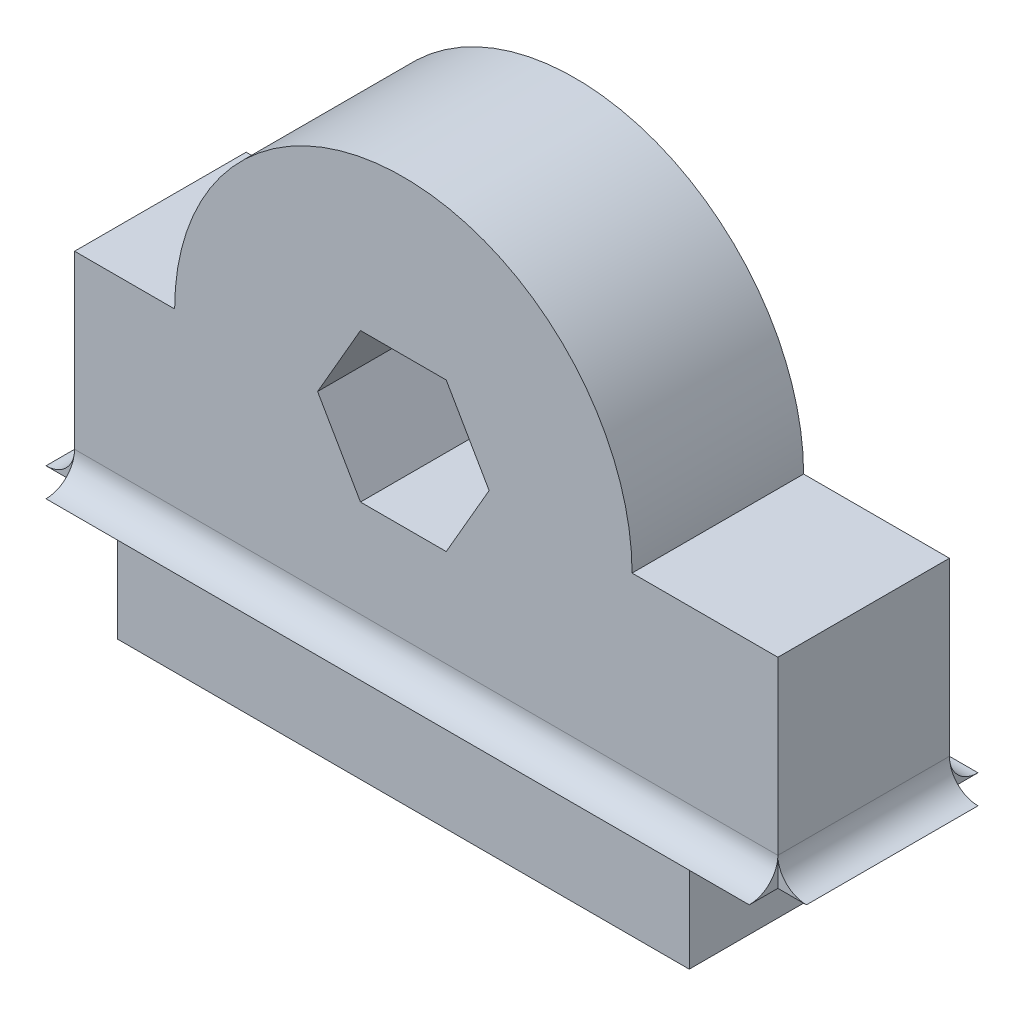
ISO-10303-21;
HEADER;
FILE_DESCRIPTION(('STEP AP214'),'2;1');
FILE_NAME('part.step','',(''),(''),'','','');
FILE_SCHEMA(('AUTOMOTIVE_DESIGN { 1 0 10303 214 1 1 1 1 }'));
ENDSEC;
DATA;
#1=APPLICATION_CONTEXT('core data for automotive mechanical design processes');
#2=APPLICATION_PROTOCOL_DEFINITION('international standard','automotive_design',2000,#1);
#3=PRODUCT_CONTEXT('',#1,'mechanical');
#4=PRODUCT('Part','Part','',(#3));
#5=PRODUCT_RELATED_PRODUCT_CATEGORY('part','',(#4));
#6=PRODUCT_DEFINITION_FORMATION('','',#4);
#7=PRODUCT_DEFINITION_CONTEXT('part definition',#1,'design');
#8=PRODUCT_DEFINITION('design','',#6,#7);
#9=PRODUCT_DEFINITION_SHAPE('','',#8);
#10=(LENGTH_UNIT() NAMED_UNIT(*) SI_UNIT(.MILLI.,.METRE.));
#11=(NAMED_UNIT(*) PLANE_ANGLE_UNIT() SI_UNIT($,.RADIAN.));
#12=(NAMED_UNIT(*) SI_UNIT($,.STERADIAN.) SOLID_ANGLE_UNIT());
#13=UNCERTAINTY_MEASURE_WITH_UNIT(LENGTH_MEASURE(1.E-05),#10,'distance_accuracy_value','');
#14=(GEOMETRIC_REPRESENTATION_CONTEXT(3) GLOBAL_UNCERTAINTY_ASSIGNED_CONTEXT((#13)) GLOBAL_UNIT_ASSIGNED_CONTEXT((#10,
#11,#12)) REPRESENTATION_CONTEXT('',''));
#15=CARTESIAN_POINT('',(0.,0.,0.));
#16=DIRECTION('',(0.,0.,1.));
#17=DIRECTION('',(1.,0.,0.));
#18=AXIS2_PLACEMENT_3D('',#15,#16,#17);
#19=CARTESIAN_POINT('',(-1.5,4.,6.));
#20=DIRECTION('',(1.,0.,0.));
#21=DIRECTION('',(0.,0.,-1.));
#22=AXIS2_PLACEMENT_3D('',#19,#20,#21);
#23=PLANE('',#22);
#24=DIRECTION('',(0.,1.,0.));
#25=VECTOR('',#24,1.);
#26=CARTESIAN_POINT('',(-1.5,4.,6.));
#27=LINE('',#26,#25);
#28=CARTESIAN_POINT('',(-1.5,4.,6.));
#29=VERTEX_POINT('',#28);
#30=CARTESIAN_POINT('',(-1.49999999999999,5.,6.));
#31=VERTEX_POINT('',#30);
#32=EDGE_CURVE('E190',#29,#31,#27,.T.);
#33=ORIENTED_EDGE('',*,*,#32,.F.);
#34=DIRECTION('',(0.,0.,-1.));
#35=VECTOR('',#34,1.);
#36=CARTESIAN_POINT('',(-1.5,4.,6.));
#37=LINE('',#36,#35);
#38=CARTESIAN_POINT('',(-1.5,4.,7.));
#39=VERTEX_POINT('',#38);
#40=EDGE_CURVE('E196',#39,#29,#37,.T.);
#41=ORIENTED_EDGE('',*,*,#40,.F.);
#42=CARTESIAN_POINT('',(-1.5,5.,7.));
#43=DIRECTION('',(1.,0.,0.));
#44=DIRECTION('',(0.,0.,1.));
#45=AXIS2_PLACEMENT_3D('',#42,#43,#44);
#46=CIRCLE('',#45,1.);
#47=EDGE_CURVE('E236',#39,#31,#46,.T.);
#48=ORIENTED_EDGE('',*,*,#47,.T.);
#49=EDGE_LOOP('',(#33,#41,#48));
#50=FACE_BOUND('',#49,.T.);
#51=ADVANCED_FACE('F33',(#50),#23,.F.);
#52=DIRECTION('',(0.,0.,1.));
#53=VECTOR('',#52,1.);
#54=CARTESIAN_POINT('',(-1.49999999999999,5.,-1.4142135623731));
#55=LINE('',#54,#53);
#56=CARTESIAN_POINT('',(-1.49999999999999,5.,0.));
#57=VERTEX_POINT('',#56);
#58=EDGE_CURVE('E189',#57,#31,#55,.T.);
#59=ORIENTED_EDGE('',*,*,#58,.T.);
#60=DIRECTION('',(0.,-1.,0.));
#61=VECTOR('',#60,1.);
#62=CARTESIAN_POINT('',(-1.5,4.,6.));
#63=LINE('',#62,#61);
#64=CARTESIAN_POINT('',(-1.5,11.,6.));
#65=VERTEX_POINT('',#64);
#66=EDGE_CURVE('E321',#65,#31,#63,.T.);
#67=ORIENTED_EDGE('',*,*,#66,.F.);
#68=DIRECTION('',(0.,0.,-1.));
#69=VECTOR('',#68,1.);
#70=CARTESIAN_POINT('',(-1.5,11.,6.));
#71=LINE('',#70,#69);
#72=CARTESIAN_POINT('',(-1.5,11.,0.));
#73=VERTEX_POINT('',#72);
#74=EDGE_CURVE('E346',#65,#73,#71,.T.);
#75=ORIENTED_EDGE('',*,*,#74,.T.);
#76=DIRECTION('',(0.,-1.,0.));
#77=VECTOR('',#76,1.);
#78=CARTESIAN_POINT('',(-1.5,4.,0.));
#79=LINE('',#78,#77);
#80=EDGE_CURVE('E309',#73,#57,#79,.T.);
#81=ORIENTED_EDGE('',*,*,#80,.T.);
#82=EDGE_LOOP('',(#59,#67,#75,#81));
#83=FACE_BOUND('',#82,.T.);
#84=ADVANCED_FACE('F389',(#83),#23,.F.);
#85=DIRECTION('',(0.,-1.,0.));
#86=VECTOR('',#85,1.);
#87=CARTESIAN_POINT('',(-1.5,4.,0.));
#88=LINE('',#87,#86);
#89=CARTESIAN_POINT('',(-1.5,4.,0.));
#90=VERTEX_POINT('',#89);
#91=EDGE_CURVE('E207',#57,#90,#88,.T.);
#92=ORIENTED_EDGE('',*,*,#91,.F.);
#93=CARTESIAN_POINT('',(-1.5,5.,-1.));
#94=DIRECTION('',(1.,0.,0.));
#95=DIRECTION('',(0.,0.,-1.));
#96=AXIS2_PLACEMENT_3D('',#93,#94,#95);
#97=CIRCLE('',#96,1.);
#98=CARTESIAN_POINT('',(-1.5,4.,-1.));
#99=VERTEX_POINT('',#98);
#100=EDGE_CURVE('E232',#57,#99,#97,.T.);
#101=ORIENTED_EDGE('',*,*,#100,.T.);
#102=EDGE_CURVE('E344',#90,#99,#37,.T.);
#103=ORIENTED_EDGE('',*,*,#102,.F.);
#104=EDGE_LOOP('',(#92,#101,#103));
#105=FACE_BOUND('',#104,.T.);
#106=ADVANCED_FACE('F392',(#105),#23,.F.);
#107=CARTESIAN_POINT('',(23.1,11.,6.));
#108=DIRECTION('',(-1.,0.,0.));
#109=DIRECTION('',(0.,0.,1.));
#110=AXIS2_PLACEMENT_3D('',#107,#108,#109);
#111=PLANE('',#110);
#112=DIRECTION('',(0.,0.,-1.));
#113=VECTOR('',#112,1.);
#114=CARTESIAN_POINT('',(23.1,4.,6.));
#115=LINE('',#114,#113);
#116=CARTESIAN_POINT('',(23.1,4.,7.));
#117=VERTEX_POINT('',#116);
#118=CARTESIAN_POINT('',(23.1,4.,6.));
#119=VERTEX_POINT('',#118);
#120=EDGE_CURVE('E56',#117,#119,#115,.T.);
#121=ORIENTED_EDGE('',*,*,#120,.T.);
#122=DIRECTION('',(0.,-1.,0.));
#123=VECTOR('',#122,1.);
#124=CARTESIAN_POINT('',(23.1,4.,6.));
#125=LINE('',#124,#123);
#126=CARTESIAN_POINT('',(23.1,5.,6.));
#127=VERTEX_POINT('',#126);
#128=EDGE_CURVE('E224',#127,#119,#125,.T.);
#129=ORIENTED_EDGE('',*,*,#128,.F.);
#130=CARTESIAN_POINT('',(23.1,5.,7.));
#131=DIRECTION('',(-1.,0.,0.));
#132=DIRECTION('',(0.,0.,1.));
#133=AXIS2_PLACEMENT_3D('',#130,#131,#132);
#134=CIRCLE('',#133,1.);
#135=EDGE_CURVE('E253',#127,#117,#134,.T.);
#136=ORIENTED_EDGE('',*,*,#135,.T.);
#137=EDGE_LOOP('',(#121,#129,#136));
#138=FACE_BOUND('',#137,.T.);
#139=ADVANCED_FACE('F400',(#138),#111,.F.);
#140=DIRECTION('',(0.,1.,0.));
#141=VECTOR('',#140,1.);
#142=CARTESIAN_POINT('',(23.1,4.,0.));
#143=LINE('',#142,#141);
#144=CARTESIAN_POINT('',(23.1,4.,0.));
#145=VERTEX_POINT('',#144);
#146=CARTESIAN_POINT('',(23.1,5.,0.));
#147=VERTEX_POINT('',#146);
#148=EDGE_CURVE('E211',#145,#147,#143,.T.);
#149=ORIENTED_EDGE('',*,*,#148,.F.);
#150=CARTESIAN_POINT('',(23.1,4.,-1.));
#151=VERTEX_POINT('',#150);
#152=EDGE_CURVE('E358',#145,#151,#115,.T.);
#153=ORIENTED_EDGE('',*,*,#152,.T.);
#154=CARTESIAN_POINT('',(23.1,5.,-1.));
#155=DIRECTION('',(-1.,0.,0.));
#156=DIRECTION('',(0.,0.,1.));
#157=AXIS2_PLACEMENT_3D('',#154,#155,#156);
#158=CIRCLE('',#157,1.);
#159=EDGE_CURVE('E233',#151,#147,#158,.T.);
#160=ORIENTED_EDGE('',*,*,#159,.T.);
#161=EDGE_LOOP('',(#149,#153,#160));
#162=FACE_BOUND('',#161,.T.);
#163=ADVANCED_FACE('F405',(#162),#111,.F.);
#164=CARTESIAN_POINT('',(10.,11.,0.));
#165=DIRECTION('',(0.,0.,1.));
#166=DIRECTION('',(1.,0.,0.));
#167=AXIS2_PLACEMENT_3D('',#164,#165,#166);
#168=PLANE('',#167);
#169=DIRECTION('',(0.499999999999995,0.866025403784441,0.));
#170=VECTOR('',#169,1.);
#171=CARTESIAN_POINT('',(11.5,8.4019237886467,0.));
#172=LINE('',#171,#170);
#173=CARTESIAN_POINT('',(11.5,8.4019237886467,0.));
#174=VERTEX_POINT('',#173);
#175=CARTESIAN_POINT('',(13.,11.,0.));
#176=VERTEX_POINT('',#175);
#177=EDGE_CURVE('E259',#174,#176,#172,.T.);
#178=ORIENTED_EDGE('',*,*,#177,.T.);
#179=DIRECTION('',(-0.500000000000001,0.866025403784438,0.));
#180=VECTOR('',#179,1.);
#181=CARTESIAN_POINT('',(13.,11.,0.));
#182=LINE('',#181,#180);
#183=CARTESIAN_POINT('',(11.5,13.5980762113533,0.));
#184=VERTEX_POINT('',#183);
#185=EDGE_CURVE('E277',#176,#184,#182,.T.);
#186=ORIENTED_EDGE('',*,*,#185,.T.);
#187=DIRECTION('',(-1.,0.,0.));
#188=VECTOR('',#187,1.);
#189=CARTESIAN_POINT('',(11.5,13.5980762113533,0.));
#190=LINE('',#189,#188);
#191=CARTESIAN_POINT('',(8.49999999999999,13.5980762113533,0.));
#192=VERTEX_POINT('',#191);
#193=EDGE_CURVE('E280',#184,#192,#190,.T.);
#194=ORIENTED_EDGE('',*,*,#193,.T.);
#195=DIRECTION('',(-0.499999999999995,-0.866025403784441,0.));
#196=VECTOR('',#195,1.);
#197=CARTESIAN_POINT('',(8.49999999999999,13.5980762113533,0.));
#198=LINE('',#197,#196);
#199=CARTESIAN_POINT('',(7.,11.,0.));
#200=VERTEX_POINT('',#199);
#201=EDGE_CURVE('E283',#192,#200,#198,.T.);
#202=ORIENTED_EDGE('',*,*,#201,.T.);
#203=DIRECTION('',(0.500000000000007,-0.866025403784435,0.));
#204=VECTOR('',#203,1.);
#205=CARTESIAN_POINT('',(7.,11.,0.));
#206=LINE('',#205,#204);
#207=CARTESIAN_POINT('',(8.50000000000002,8.40192378864667,0.));
#208=VERTEX_POINT('',#207);
#209=EDGE_CURVE('E286',#200,#208,#206,.T.);
#210=ORIENTED_EDGE('',*,*,#209,.T.);
#211=DIRECTION('',(1.,0.,0.));
#212=VECTOR('',#211,1.);
#213=CARTESIAN_POINT('',(8.50000000000002,8.40192378864667,0.));
#214=LINE('',#213,#212);
#215=EDGE_CURVE('E263',#208,#174,#214,.T.);
#216=ORIENTED_EDGE('',*,*,#215,.T.);
#217=EDGE_LOOP('',(#178,#186,#194,#202,#210,#216));
#218=FACE_BOUND('',#217,.T.);
#219=DIRECTION('',(-1.,0.,0.));
#220=VECTOR('',#219,1.);
#221=CARTESIAN_POINT('',(24.5142135623731,5.,0.));
#222=LINE('',#221,#220);
#223=EDGE_CURVE('E237',#147,#57,#222,.T.);
#224=ORIENTED_EDGE('',*,*,#223,.T.);
#225=ORIENTED_EDGE('',*,*,#80,.F.);
#226=DIRECTION('',(-1.,0.,0.));
#227=VECTOR('',#226,1.);
#228=CARTESIAN_POINT('',(-1.5,11.,0.));
#229=LINE('',#228,#227);
#230=CARTESIAN_POINT('',(2.,11.,0.));
#231=VERTEX_POINT('',#230);
#232=EDGE_CURVE('E338',#231,#73,#229,.T.);
#233=ORIENTED_EDGE('',*,*,#232,.F.);
#234=CARTESIAN_POINT('',(10.,11.,0.));
#235=DIRECTION('',(0.,0.,1.));
#236=DIRECTION('',(1.,0.,0.));
#237=AXIS2_PLACEMENT_3D('',#234,#235,#236);
#238=CIRCLE('',#237,8.);
#239=CARTESIAN_POINT('',(18.,11.,0.));
#240=VERTEX_POINT('',#239);
#241=EDGE_CURVE('E336',#240,#231,#238,.T.);
#242=ORIENTED_EDGE('',*,*,#241,.F.);
#243=DIRECTION('',(-1.,0.,0.));
#244=VECTOR('',#243,1.);
#245=CARTESIAN_POINT('',(18.,11.,0.));
#246=LINE('',#245,#244);
#247=CARTESIAN_POINT('',(23.1,11.,0.));
#248=VERTEX_POINT('',#247);
#249=EDGE_CURVE('E334',#248,#240,#246,.T.);
#250=ORIENTED_EDGE('',*,*,#249,.F.);
#251=DIRECTION('',(0.,1.,0.));
#252=VECTOR('',#251,1.);
#253=CARTESIAN_POINT('',(23.1,11.,0.));
#254=LINE('',#253,#252);
#255=EDGE_CURVE('E332',#147,#248,#254,.T.);
#256=ORIENTED_EDGE('',*,*,#255,.F.);
#257=EDGE_LOOP('',(#224,#225,#233,#242,#250,#256));
#258=FACE_BOUND('',#257,.T.);
#259=ADVANCED_FACE('F419',(#218,#258),#168,.F.);
#260=CARTESIAN_POINT('',(10.,11.,6.));
#261=DIRECTION('',(0.,0.,1.));
#262=DIRECTION('',(1.,0.,0.));
#263=AXIS2_PLACEMENT_3D('',#260,#261,#262);
#264=PLANE('',#263);
#265=DIRECTION('',(-0.500000000000001,0.866025403784438,0.));
#266=VECTOR('',#265,1.);
#267=CARTESIAN_POINT('',(13.,11.,6.));
#268=LINE('',#267,#266);
#269=CARTESIAN_POINT('',(13.,11.,6.));
#270=VERTEX_POINT('',#269);
#271=CARTESIAN_POINT('',(11.5,13.5980762113533,6.));
#272=VERTEX_POINT('',#271);
#273=EDGE_CURVE('E262',#270,#272,#268,.T.);
#274=ORIENTED_EDGE('',*,*,#273,.F.);
#275=DIRECTION('',(0.499999999999995,0.866025403784441,0.));
#276=VECTOR('',#275,1.);
#277=CARTESIAN_POINT('',(11.5,8.4019237886467,6.));
#278=LINE('',#277,#276);
#279=CARTESIAN_POINT('',(11.5,8.4019237886467,6.));
#280=VERTEX_POINT('',#279);
#281=EDGE_CURVE('E260',#280,#270,#278,.T.);
#282=ORIENTED_EDGE('',*,*,#281,.F.);
#283=DIRECTION('',(1.,0.,0.));
#284=VECTOR('',#283,1.);
#285=CARTESIAN_POINT('',(8.50000000000002,8.40192378864667,6.));
#286=LINE('',#285,#284);
#287=CARTESIAN_POINT('',(8.50000000000002,8.40192378864667,6.));
#288=VERTEX_POINT('',#287);
#289=EDGE_CURVE('E272',#288,#280,#286,.T.);
#290=ORIENTED_EDGE('',*,*,#289,.F.);
#291=DIRECTION('',(0.500000000000007,-0.866025403784435,0.));
#292=VECTOR('',#291,1.);
#293=CARTESIAN_POINT('',(7.,11.,6.));
#294=LINE('',#293,#292);
#295=CARTESIAN_POINT('',(7.,11.,6.));
#296=VERTEX_POINT('',#295);
#297=EDGE_CURVE('E269',#296,#288,#294,.T.);
#298=ORIENTED_EDGE('',*,*,#297,.F.);
#299=DIRECTION('',(-0.499999999999995,-0.866025403784441,0.));
#300=VECTOR('',#299,1.);
#301=CARTESIAN_POINT('',(8.49999999999999,13.5980762113533,6.));
#302=LINE('',#301,#300);
#303=CARTESIAN_POINT('',(8.49999999999999,13.5980762113533,6.));
#304=VERTEX_POINT('',#303);
#305=EDGE_CURVE('E267',#304,#296,#302,.T.);
#306=ORIENTED_EDGE('',*,*,#305,.F.);
#307=DIRECTION('',(-1.,0.,0.));
#308=VECTOR('',#307,1.);
#309=CARTESIAN_POINT('',(11.5,13.5980762113533,6.));
#310=LINE('',#309,#308);
#311=EDGE_CURVE('E265',#272,#304,#310,.T.);
#312=ORIENTED_EDGE('',*,*,#311,.F.);
#313=EDGE_LOOP('',(#274,#282,#290,#298,#306,#312));
#314=FACE_BOUND('',#313,.T.);
#315=ORIENTED_EDGE('',*,*,#66,.T.);
#316=DIRECTION('',(-1.,0.,0.));
#317=VECTOR('',#316,1.);
#318=CARTESIAN_POINT('',(24.5142135623731,5.,6.));
#319=LINE('',#318,#317);
#320=EDGE_CURVE('E254',#127,#31,#319,.T.);
#321=ORIENTED_EDGE('',*,*,#320,.F.);
#322=DIRECTION('',(0.,1.,0.));
#323=VECTOR('',#322,1.);
#324=CARTESIAN_POINT('',(23.1,11.,6.));
#325=LINE('',#324,#323);
#326=CARTESIAN_POINT('',(23.1,11.,6.));
#327=VERTEX_POINT('',#326);
#328=EDGE_CURVE('E313',#127,#327,#325,.T.);
#329=ORIENTED_EDGE('',*,*,#328,.T.);
#330=DIRECTION('',(-1.,0.,0.));
#331=VECTOR('',#330,1.);
#332=CARTESIAN_POINT('',(18.,11.,6.));
#333=LINE('',#332,#331);
#334=CARTESIAN_POINT('',(18.,11.,6.));
#335=VERTEX_POINT('',#334);
#336=EDGE_CURVE('E315',#327,#335,#333,.T.);
#337=ORIENTED_EDGE('',*,*,#336,.T.);
#338=CARTESIAN_POINT('',(10.,11.,6.));
#339=DIRECTION('',(0.,0.,1.));
#340=DIRECTION('',(1.,0.,0.));
#341=AXIS2_PLACEMENT_3D('',#338,#339,#340);
#342=CIRCLE('',#341,8.);
#343=CARTESIAN_POINT('',(2.,11.,6.));
#344=VERTEX_POINT('',#343);
#345=EDGE_CURVE('E317',#335,#344,#342,.T.);
#346=ORIENTED_EDGE('',*,*,#345,.T.);
#347=DIRECTION('',(-1.,0.,0.));
#348=VECTOR('',#347,1.);
#349=CARTESIAN_POINT('',(-1.5,11.,6.));
#350=LINE('',#349,#348);
#351=EDGE_CURVE('E319',#344,#65,#350,.T.);
#352=ORIENTED_EDGE('',*,*,#351,.T.);
#353=EDGE_LOOP('',(#315,#321,#329,#337,#346,#352));
#354=FACE_BOUND('',#353,.T.);
#355=ADVANCED_FACE('F457',(#314,#354),#264,.T.);
#356=DIRECTION('',(-1.,0.,0.));
#357=VECTOR('',#356,1.);
#358=CARTESIAN_POINT('',(24.5142135623731,4.,6.));
#359=LINE('',#358,#357);
#360=CARTESIAN_POINT('',(20.,4.,6.));
#361=VERTEX_POINT('',#360);
#362=CARTESIAN_POINT('',(0.,4.,6.));
#363=VERTEX_POINT('',#362);
#364=EDGE_CURVE('E250',#361,#363,#359,.T.);
#365=ORIENTED_EDGE('',*,*,#364,.T.);
#366=DIRECTION('',(0.,-1.,0.));
#367=VECTOR('',#366,1.);
#368=CARTESIAN_POINT('',(0.,0.,6.));
#369=LINE('',#368,#367);
#370=CARTESIAN_POINT('',(0.,0.,6.));
#371=VERTEX_POINT('',#370);
#372=EDGE_CURVE('E305',#363,#371,#369,.T.);
#373=ORIENTED_EDGE('',*,*,#372,.T.);
#374=DIRECTION('',(1.,0.,0.));
#375=VECTOR('',#374,1.);
#376=CARTESIAN_POINT('',(0.,0.,6.));
#377=LINE('',#376,#375);
#378=CARTESIAN_POINT('',(20.,0.,6.));
#379=VERTEX_POINT('',#378);
#380=EDGE_CURVE('E308',#371,#379,#377,.T.);
#381=ORIENTED_EDGE('',*,*,#380,.T.);
#382=DIRECTION('',(0.,1.,0.));
#383=VECTOR('',#382,1.);
#384=CARTESIAN_POINT('',(20.,0.,6.));
#385=LINE('',#384,#383);
#386=EDGE_CURVE('E311',#379,#361,#385,.T.);
#387=ORIENTED_EDGE('',*,*,#386,.T.);
#388=EDGE_LOOP('',(#365,#373,#381,#387));
#389=FACE_BOUND('',#388,.T.);
#390=ADVANCED_FACE('F379',(#389),#264,.T.);
#391=DIRECTION('',(0.,-1.,0.));
#392=VECTOR('',#391,1.);
#393=CARTESIAN_POINT('',(0.,0.,0.));
#394=LINE('',#393,#392);
#395=CARTESIAN_POINT('',(0.,4.,0.));
#396=VERTEX_POINT('',#395);
#397=CARTESIAN_POINT('',(0.,0.,0.));
#398=VERTEX_POINT('',#397);
#399=EDGE_CURVE('E304',#396,#398,#394,.T.);
#400=ORIENTED_EDGE('',*,*,#399,.F.);
#401=DIRECTION('',(-1.,0.,0.));
#402=VECTOR('',#401,1.);
#403=CARTESIAN_POINT('',(24.5142135623731,4.,0.));
#404=LINE('',#403,#402);
#405=CARTESIAN_POINT('',(20.,4.,0.));
#406=VERTEX_POINT('',#405);
#407=EDGE_CURVE('E243',#406,#396,#404,.T.);
#408=ORIENTED_EDGE('',*,*,#407,.F.);
#409=DIRECTION('',(0.,1.,0.));
#410=VECTOR('',#409,1.);
#411=CARTESIAN_POINT('',(20.,0.,0.));
#412=LINE('',#411,#410);
#413=CARTESIAN_POINT('',(20.,0.,0.));
#414=VERTEX_POINT('',#413);
#415=EDGE_CURVE('E329',#414,#406,#412,.T.);
#416=ORIENTED_EDGE('',*,*,#415,.F.);
#417=DIRECTION('',(1.,0.,0.));
#418=VECTOR('',#417,1.);
#419=CARTESIAN_POINT('',(0.,0.,0.));
#420=LINE('',#419,#418);
#421=EDGE_CURVE('E327',#398,#414,#420,.T.);
#422=ORIENTED_EDGE('',*,*,#421,.F.);
#423=EDGE_LOOP('',(#400,#408,#416,#422));
#424=FACE_BOUND('',#423,.T.);
#425=ADVANCED_FACE('F372',(#424),#168,.F.);
#426=CARTESIAN_POINT('',(0.,0.,6.));
#427=DIRECTION('',(1.,0.,0.));
#428=DIRECTION('',(0.,0.,-1.));
#429=AXIS2_PLACEMENT_3D('',#426,#427,#428);
#430=PLANE('',#429);
#431=ORIENTED_EDGE('',*,*,#399,.T.);
#432=DIRECTION('',(0.,0.,-1.));
#433=VECTOR('',#432,1.);
#434=CARTESIAN_POINT('',(0.,0.,6.));
#435=LINE('',#434,#433);
#436=EDGE_CURVE('E11',#371,#398,#435,.T.);
#437=ORIENTED_EDGE('',*,*,#436,.F.);
#438=ORIENTED_EDGE('',*,*,#372,.F.);
#439=DIRECTION('',(0.,0.,-1.));
#440=VECTOR('',#439,1.);
#441=CARTESIAN_POINT('',(0.,4.,6.));
#442=LINE('',#441,#440);
#443=EDGE_CURVE('E324',#363,#396,#442,.T.);
#444=ORIENTED_EDGE('',*,*,#443,.T.);
#445=EDGE_LOOP('',(#431,#437,#438,#444));
#446=FACE_BOUND('',#445,.T.);
#447=ADVANCED_FACE('F35',(#446),#430,.F.);
#448=CARTESIAN_POINT('',(0.,0.,6.));
#449=DIRECTION('',(0.,1.,0.));
#450=DIRECTION('',(0.,0.,1.));
#451=AXIS2_PLACEMENT_3D('',#448,#449,#450);
#452=PLANE('',#451);
#453=ORIENTED_EDGE('',*,*,#421,.T.);
#454=DIRECTION('',(0.,0.,-1.));
#455=VECTOR('',#454,1.);
#456=CARTESIAN_POINT('',(20.,0.,6.));
#457=LINE('',#456,#455);
#458=EDGE_CURVE('E41',#379,#414,#457,.T.);
#459=ORIENTED_EDGE('',*,*,#458,.F.);
#460=ORIENTED_EDGE('',*,*,#380,.F.);
#461=ORIENTED_EDGE('',*,*,#436,.T.);
#462=EDGE_LOOP('',(#453,#459,#460,#461));
#463=FACE_BOUND('',#462,.T.);
#464=ADVANCED_FACE('F380',(#463),#452,.F.);
#465=CARTESIAN_POINT('',(20.,0.,6.));
#466=DIRECTION('',(-1.,0.,0.));
#467=DIRECTION('',(0.,0.,1.));
#468=AXIS2_PLACEMENT_3D('',#465,#466,#467);
#469=PLANE('',#468);
#470=ORIENTED_EDGE('',*,*,#415,.T.);
#471=DIRECTION('',(0.,0.,-1.));
#472=VECTOR('',#471,1.);
#473=CARTESIAN_POINT('',(20.,4.,6.));
#474=LINE('',#473,#472);
#475=EDGE_CURVE('E360',#361,#406,#474,.T.);
#476=ORIENTED_EDGE('',*,*,#475,.F.);
#477=ORIENTED_EDGE('',*,*,#386,.F.);
#478=ORIENTED_EDGE('',*,*,#458,.T.);
#479=EDGE_LOOP('',(#470,#476,#477,#478));
#480=FACE_BOUND('',#479,.T.);
#481=ADVANCED_FACE('F367',(#480),#469,.F.);
#482=ORIENTED_EDGE('',*,*,#328,.F.);
#483=DIRECTION('',(0.,0.,1.));
#484=VECTOR('',#483,1.);
#485=CARTESIAN_POINT('',(23.1,5.,-1.4142135623731));
#486=LINE('',#485,#484);
#487=EDGE_CURVE('E215',#147,#127,#486,.T.);
#488=ORIENTED_EDGE('',*,*,#487,.F.);
#489=ORIENTED_EDGE('',*,*,#255,.T.);
#490=DIRECTION('',(0.,0.,-1.));
#491=VECTOR('',#490,1.);
#492=CARTESIAN_POINT('',(23.1,11.,6.));
#493=LINE('',#492,#491);
#494=EDGE_CURVE('E355',#327,#248,#493,.T.);
#495=ORIENTED_EDGE('',*,*,#494,.F.);
#496=EDGE_LOOP('',(#482,#488,#489,#495));
#497=FACE_BOUND('',#496,.T.);
#498=ADVANCED_FACE('F386',(#497),#111,.F.);
#499=CARTESIAN_POINT('',(18.,11.,6.));
#500=DIRECTION('',(0.,-1.,0.));
#501=DIRECTION('',(1.,0.,0.));
#502=AXIS2_PLACEMENT_3D('',#499,#500,#501);
#503=PLANE('',#502);
#504=ORIENTED_EDGE('',*,*,#249,.T.);
#505=DIRECTION('',(0.,0.,-1.));
#506=VECTOR('',#505,1.);
#507=CARTESIAN_POINT('',(18.,11.,6.));
#508=LINE('',#507,#506);
#509=EDGE_CURVE('E352',#335,#240,#508,.T.);
#510=ORIENTED_EDGE('',*,*,#509,.F.);
#511=ORIENTED_EDGE('',*,*,#336,.F.);
#512=ORIENTED_EDGE('',*,*,#494,.T.);
#513=EDGE_LOOP('',(#504,#510,#511,#512));
#514=FACE_BOUND('',#513,.T.);
#515=ADVANCED_FACE('F435',(#514),#503,.F.);
#516=CARTESIAN_POINT('',(10.,11.,6.));
#517=DIRECTION('',(0.,0.,-1.));
#518=DIRECTION('',(-1.,0.,0.));
#519=AXIS2_PLACEMENT_3D('',#516,#517,#518);
#520=CYLINDRICAL_SURFACE('',#519,8.);
#521=ORIENTED_EDGE('',*,*,#241,.T.);
#522=DIRECTION('',(0.,0.,-1.));
#523=VECTOR('',#522,1.);
#524=CARTESIAN_POINT('',(2.,11.,6.));
#525=LINE('',#524,#523);
#526=EDGE_CURVE('E349',#344,#231,#525,.T.);
#527=ORIENTED_EDGE('',*,*,#526,.F.);
#528=ORIENTED_EDGE('',*,*,#345,.F.);
#529=ORIENTED_EDGE('',*,*,#509,.T.);
#530=EDGE_LOOP('',(#521,#527,#528,#529));
#531=FACE_BOUND('',#530,.T.);
#532=ADVANCED_FACE('F430',(#531),#520,.T.);
#533=CARTESIAN_POINT('',(-1.5,11.,6.));
#534=DIRECTION('',(0.,-1.,0.));
#535=DIRECTION('',(0.,0.,-1.));
#536=AXIS2_PLACEMENT_3D('',#533,#534,#535);
#537=PLANE('',#536);
#538=ORIENTED_EDGE('',*,*,#232,.T.);
#539=ORIENTED_EDGE('',*,*,#74,.F.);
#540=ORIENTED_EDGE('',*,*,#351,.F.);
#541=ORIENTED_EDGE('',*,*,#526,.T.);
#542=EDGE_LOOP('',(#538,#539,#540,#541));
#543=FACE_BOUND('',#542,.T.);
#544=ADVANCED_FACE('F426',(#543),#537,.F.);
#545=CARTESIAN_POINT('',(0.,4.,6.));
#546=DIRECTION('',(0.,1.,0.));
#547=DIRECTION('',(0.,0.,1.));
#548=AXIS2_PLACEMENT_3D('',#545,#546,#547);
#549=PLANE('',#548);
#550=ORIENTED_EDGE('',*,*,#407,.T.);
#551=ORIENTED_EDGE('',*,*,#443,.F.);
#552=ORIENTED_EDGE('',*,*,#364,.F.);
#553=ORIENTED_EDGE('',*,*,#475,.T.);
#554=EDGE_LOOP('',(#550,#551,#552,#553));
#555=FACE_BOUND('',#554,.T.);
#556=ORIENTED_EDGE('',*,*,#40,.T.);
#557=DIRECTION('',(1.,0.,0.));
#558=VECTOR('',#557,1.);
#559=CARTESIAN_POINT('',(-1.5,4.,6.));
#560=LINE('',#559,#558);
#561=CARTESIAN_POINT('',(-2.5,4.,6.));
#562=VERTEX_POINT('',#561);
#563=EDGE_CURVE('E193',#562,#29,#560,.T.);
#564=ORIENTED_EDGE('',*,*,#563,.F.);
#565=DIRECTION('',(0.,0.,1.));
#566=VECTOR('',#565,1.);
#567=CARTESIAN_POINT('',(-2.5,4.,-1.4142135623731));
#568=LINE('',#567,#566);
#569=CARTESIAN_POINT('',(-2.5,4.,0.));
#570=VERTEX_POINT('',#569);
#571=EDGE_CURVE('E181',#570,#562,#568,.T.);
#572=ORIENTED_EDGE('',*,*,#571,.F.);
#573=DIRECTION('',(-1.,0.,0.));
#574=VECTOR('',#573,1.);
#575=CARTESIAN_POINT('',(-1.5,4.,0.));
#576=LINE('',#575,#574);
#577=EDGE_CURVE('E48',#90,#570,#576,.T.);
#578=ORIENTED_EDGE('',*,*,#577,.F.);
#579=ORIENTED_EDGE('',*,*,#102,.T.);
#580=DIRECTION('',(-1.,0.,0.));
#581=VECTOR('',#580,1.);
#582=CARTESIAN_POINT('',(24.5142135623731,4.,-1.));
#583=LINE('',#582,#581);
#584=EDGE_CURVE('E240',#151,#99,#583,.T.);
#585=ORIENTED_EDGE('',*,*,#584,.F.);
#586=ORIENTED_EDGE('',*,*,#152,.F.);
#587=DIRECTION('',(-1.,0.,0.));
#588=VECTOR('',#587,1.);
#589=CARTESIAN_POINT('',(23.1,4.,0.));
#590=LINE('',#589,#588);
#591=CARTESIAN_POINT('',(24.1,4.,0.));
#592=VERTEX_POINT('',#591);
#593=EDGE_CURVE('E214',#592,#145,#590,.T.);
#594=ORIENTED_EDGE('',*,*,#593,.F.);
#595=DIRECTION('',(0.,0.,1.));
#596=VECTOR('',#595,1.);
#597=CARTESIAN_POINT('',(24.1,4.,-1.4142135623731));
#598=LINE('',#597,#596);
#599=CARTESIAN_POINT('',(24.1,4.,6.));
#600=VERTEX_POINT('',#599);
#601=EDGE_CURVE('E227',#592,#600,#598,.T.);
#602=ORIENTED_EDGE('',*,*,#601,.T.);
#603=DIRECTION('',(1.,0.,0.));
#604=VECTOR('',#603,1.);
#605=CARTESIAN_POINT('',(23.1,4.,6.));
#606=LINE('',#605,#604);
#607=EDGE_CURVE('E210',#119,#600,#606,.T.);
#608=ORIENTED_EDGE('',*,*,#607,.F.);
#609=ORIENTED_EDGE('',*,*,#120,.F.);
#610=DIRECTION('',(-1.,0.,0.));
#611=VECTOR('',#610,1.);
#612=CARTESIAN_POINT('',(24.5142135623731,4.,7.));
#613=LINE('',#612,#611);
#614=EDGE_CURVE('E249',#117,#39,#613,.T.);
#615=ORIENTED_EDGE('',*,*,#614,.T.);
#616=EDGE_LOOP('',(#556,#564,#572,#578,#579,#585,#586,#594,#602,#608,#609,#615));
#617=FACE_BOUND('',#616,.T.);
#618=ADVANCED_FACE('F194',(#555,#617),#549,.F.);
#619=CARTESIAN_POINT('',(11.5,8.4019237886467,6.));
#620=DIRECTION('',(-0.866025403784442,0.499999999999995,0.));
#621=DIRECTION('',(-0.499999999999995,-0.866025403784442,0.));
#622=AXIS2_PLACEMENT_3D('',#619,#620,#621);
#623=PLANE('',#622);
#624=ORIENTED_EDGE('',*,*,#177,.F.);
#625=DIRECTION('',(0.,0.,-1.));
#626=VECTOR('',#625,1.);
#627=CARTESIAN_POINT('',(11.5,8.4019237886467,6.));
#628=LINE('',#627,#626);
#629=EDGE_CURVE('E274',#280,#174,#628,.T.);
#630=ORIENTED_EDGE('',*,*,#629,.F.);
#631=ORIENTED_EDGE('',*,*,#281,.T.);
#632=DIRECTION('',(0.,0.,-1.));
#633=VECTOR('',#632,1.);
#634=CARTESIAN_POINT('',(13.,11.,6.));
#635=LINE('',#634,#633);
#636=EDGE_CURVE('E301',#270,#176,#635,.T.);
#637=ORIENTED_EDGE('',*,*,#636,.T.);
#638=EDGE_LOOP('',(#624,#630,#631,#637));
#639=FACE_BOUND('',#638,.T.);
#640=ADVANCED_FACE('F469',(#639),#623,.T.);
#641=CARTESIAN_POINT('',(13.,11.,6.));
#642=DIRECTION('',(-0.866025403784438,-0.500000000000001,0.));
#643=DIRECTION('',(0.500000000000001,-0.866025403784438,0.));
#644=AXIS2_PLACEMENT_3D('',#641,#642,#643);
#645=PLANE('',#644);
#646=ORIENTED_EDGE('',*,*,#185,.F.);
#647=ORIENTED_EDGE('',*,*,#636,.F.);
#648=ORIENTED_EDGE('',*,*,#273,.T.);
#649=DIRECTION('',(0.,0.,-1.));
#650=VECTOR('',#649,1.);
#651=CARTESIAN_POINT('',(11.5,13.5980762113533,6.));
#652=LINE('',#651,#650);
#653=EDGE_CURVE('E299',#272,#184,#652,.T.);
#654=ORIENTED_EDGE('',*,*,#653,.T.);
#655=EDGE_LOOP('',(#646,#647,#648,#654));
#656=FACE_BOUND('',#655,.T.);
#657=ADVANCED_FACE('F477',(#656),#645,.T.);
#658=CARTESIAN_POINT('',(11.5,13.5980762113533,6.));
#659=DIRECTION('',(0.,-1.,0.));
#660=DIRECTION('',(1.,0.,0.));
#661=AXIS2_PLACEMENT_3D('',#658,#659,#660);
#662=PLANE('',#661);
#663=ORIENTED_EDGE('',*,*,#193,.F.);
#664=ORIENTED_EDGE('',*,*,#653,.F.);
#665=ORIENTED_EDGE('',*,*,#311,.T.);
#666=DIRECTION('',(0.,0.,-1.));
#667=VECTOR('',#666,1.);
#668=CARTESIAN_POINT('',(8.49999999999999,13.5980762113533,6.));
#669=LINE('',#668,#667);
#670=EDGE_CURVE('E297',#304,#192,#669,.T.);
#671=ORIENTED_EDGE('',*,*,#670,.T.);
#672=EDGE_LOOP('',(#663,#664,#665,#671));
#673=FACE_BOUND('',#672,.T.);
#674=ADVANCED_FACE('F598',(#673),#662,.T.);
#675=CARTESIAN_POINT('',(8.49999999999999,13.5980762113533,6.));
#676=DIRECTION('',(0.866025403784441,-0.499999999999995,0.));
#677=DIRECTION('',(0.499999999999995,0.866025403784441,0.));
#678=AXIS2_PLACEMENT_3D('',#675,#676,#677);
#679=PLANE('',#678);
#680=ORIENTED_EDGE('',*,*,#201,.F.);
#681=ORIENTED_EDGE('',*,*,#670,.F.);
#682=ORIENTED_EDGE('',*,*,#305,.T.);
#683=DIRECTION('',(0.,0.,-1.));
#684=VECTOR('',#683,1.);
#685=CARTESIAN_POINT('',(7.,11.,6.));
#686=LINE('',#685,#684);
#687=EDGE_CURVE('E295',#296,#200,#686,.T.);
#688=ORIENTED_EDGE('',*,*,#687,.T.);
#689=EDGE_LOOP('',(#680,#681,#682,#688));
#690=FACE_BOUND('',#689,.T.);
#691=ADVANCED_FACE('F594',(#690),#679,.T.);
#692=CARTESIAN_POINT('',(7.,11.,6.));
#693=DIRECTION('',(0.866025403784435,0.500000000000007,0.));
#694=DIRECTION('',(-0.500000000000007,0.866025403784435,0.));
#695=AXIS2_PLACEMENT_3D('',#692,#693,#694);
#696=PLANE('',#695);
#697=ORIENTED_EDGE('',*,*,#209,.F.);
#698=ORIENTED_EDGE('',*,*,#687,.F.);
#699=ORIENTED_EDGE('',*,*,#297,.T.);
#700=DIRECTION('',(0.,0.,-1.));
#701=VECTOR('',#700,1.);
#702=CARTESIAN_POINT('',(8.50000000000002,8.40192378864667,6.));
#703=LINE('',#702,#701);
#704=EDGE_CURVE('E293',#288,#208,#703,.T.);
#705=ORIENTED_EDGE('',*,*,#704,.T.);
#706=EDGE_LOOP('',(#697,#698,#699,#705));
#707=FACE_BOUND('',#706,.T.);
#708=ADVANCED_FACE('F590',(#707),#696,.T.);
#709=CARTESIAN_POINT('',(8.50000000000002,8.40192378864667,6.));
#710=DIRECTION('',(0.,1.,0.));
#711=DIRECTION('',(-1.,0.,0.));
#712=AXIS2_PLACEMENT_3D('',#709,#710,#711);
#713=PLANE('',#712);
#714=ORIENTED_EDGE('',*,*,#215,.F.);
#715=ORIENTED_EDGE('',*,*,#704,.F.);
#716=ORIENTED_EDGE('',*,*,#289,.T.);
#717=ORIENTED_EDGE('',*,*,#629,.T.);
#718=EDGE_LOOP('',(#714,#715,#716,#717));
#719=FACE_BOUND('',#718,.T.);
#720=ADVANCED_FACE('F524',(#719),#713,.T.);
#721=CARTESIAN_POINT('',(24.5142135623731,5.,7.));
#722=DIRECTION('',(-1.,0.,0.));
#723=DIRECTION('',(0.,0.,1.));
#724=AXIS2_PLACEMENT_3D('',#721,#722,#723);
#725=CYLINDRICAL_SURFACE('',#724,1.);
#726=ORIENTED_EDGE('',*,*,#135,.F.);
#727=ORIENTED_EDGE('',*,*,#320,.T.);
#728=ORIENTED_EDGE('',*,*,#47,.F.);
#729=ORIENTED_EDGE('',*,*,#614,.F.);
#730=EDGE_LOOP('',(#726,#727,#728,#729));
#731=FACE_BOUND('',#730,.T.);
#732=ADVANCED_FACE('F455',(#731),#725,.F.);
#733=CARTESIAN_POINT('',(24.5142135623731,5.,-1.));
#734=DIRECTION('',(-1.,0.,0.));
#735=DIRECTION('',(0.,0.,1.));
#736=AXIS2_PLACEMENT_3D('',#733,#734,#735);
#737=CYLINDRICAL_SURFACE('',#736,1.);
#738=ORIENTED_EDGE('',*,*,#159,.F.);
#739=ORIENTED_EDGE('',*,*,#584,.T.);
#740=ORIENTED_EDGE('',*,*,#100,.F.);
#741=ORIENTED_EDGE('',*,*,#223,.F.);
#742=EDGE_LOOP('',(#738,#739,#740,#741));
#743=FACE_BOUND('',#742,.T.);
#744=ADVANCED_FACE('F414',(#743),#737,.F.);
#745=CARTESIAN_POINT('',(24.1,5.,-1.4142135623731));
#746=DIRECTION('',(0.,0.,1.));
#747=DIRECTION('',(1.,0.,0.));
#748=AXIS2_PLACEMENT_3D('',#745,#746,#747);
#749=CYLINDRICAL_SURFACE('',#748,1.);
#750=CARTESIAN_POINT('',(24.1,5.,0.));
#751=DIRECTION('',(0.,0.,1.));
#752=DIRECTION('',(1.,0.,0.));
#753=AXIS2_PLACEMENT_3D('',#750,#751,#752);
#754=CIRCLE('',#753,1.);
#755=EDGE_CURVE('E218',#147,#592,#754,.T.);
#756=ORIENTED_EDGE('',*,*,#755,.F.);
#757=ORIENTED_EDGE('',*,*,#487,.T.);
#758=CARTESIAN_POINT('',(24.1,5.,6.));
#759=DIRECTION('',(0.,0.,-1.));
#760=DIRECTION('',(1.,0.,0.));
#761=AXIS2_PLACEMENT_3D('',#758,#759,#760);
#762=CIRCLE('',#761,1.);
#763=EDGE_CURVE('E221',#600,#127,#762,.T.);
#764=ORIENTED_EDGE('',*,*,#763,.F.);
#765=ORIENTED_EDGE('',*,*,#601,.F.);
#766=EDGE_LOOP('',(#756,#757,#764,#765));
#767=FACE_BOUND('',#766,.T.);
#768=ADVANCED_FACE('F448',(#767),#749,.F.);
#769=CARTESIAN_POINT('',(24.1,5.,6.));
#770=DIRECTION('',(0.,0.,1.));
#771=DIRECTION('',(1.,0.,0.));
#772=AXIS2_PLACEMENT_3D('',#769,#770,#771);
#773=PLANE('',#772);
#774=ORIENTED_EDGE('',*,*,#607,.T.);
#775=ORIENTED_EDGE('',*,*,#763,.T.);
#776=ORIENTED_EDGE('',*,*,#128,.T.);
#777=EDGE_LOOP('',(#774,#775,#776));
#778=FACE_BOUND('',#777,.T.);
#779=ADVANCED_FACE('F450',(#778),#773,.T.);
#780=CARTESIAN_POINT('',(10.,11.,0.));
#781=DIRECTION('',(0.,0.,1.));
#782=DIRECTION('',(1.,0.,0.));
#783=AXIS2_PLACEMENT_3D('',#780,#781,#782);
#784=PLANE('',#783);
#785=ORIENTED_EDGE('',*,*,#593,.T.);
#786=ORIENTED_EDGE('',*,*,#148,.T.);
#787=ORIENTED_EDGE('',*,*,#755,.T.);
#788=EDGE_LOOP('',(#785,#786,#787));
#789=FACE_BOUND('',#788,.T.);
#790=ADVANCED_FACE('F551',(#789),#784,.F.);
#791=CARTESIAN_POINT('',(-2.5,5.,-1.4142135623731));
#792=DIRECTION('',(0.,0.,1.));
#793=DIRECTION('',(1.,0.,0.));
#794=AXIS2_PLACEMENT_3D('',#791,#792,#793);
#795=CYLINDRICAL_SURFACE('',#794,1.);
#796=CARTESIAN_POINT('',(-2.5,5.,0.));
#797=DIRECTION('',(0.,0.,1.));
#798=DIRECTION('',(1.,0.,0.));
#799=AXIS2_PLACEMENT_3D('',#796,#797,#798);
#800=CIRCLE('',#799,1.);
#801=EDGE_CURVE('E188',#570,#57,#800,.T.);
#802=ORIENTED_EDGE('',*,*,#801,.F.);
#803=ORIENTED_EDGE('',*,*,#571,.T.);
#804=CARTESIAN_POINT('',(-2.5,5.,6.));
#805=DIRECTION('',(0.,0.,-1.));
#806=DIRECTION('',(-1.,0.,0.));
#807=AXIS2_PLACEMENT_3D('',#804,#805,#806);
#808=CIRCLE('',#807,1.);
#809=EDGE_CURVE('E186',#31,#562,#808,.T.);
#810=ORIENTED_EDGE('',*,*,#809,.F.);
#811=ORIENTED_EDGE('',*,*,#58,.F.);
#812=EDGE_LOOP('',(#802,#803,#810,#811));
#813=FACE_BOUND('',#812,.T.);
#814=ADVANCED_FACE('F183',(#813),#795,.F.);
#815=CARTESIAN_POINT('',(-2.5,5.,6.));
#816=DIRECTION('',(0.,0.,-1.));
#817=DIRECTION('',(-1.,0.,0.));
#818=AXIS2_PLACEMENT_3D('',#815,#816,#817);
#819=PLANE('',#818);
#820=ORIENTED_EDGE('',*,*,#809,.T.);
#821=ORIENTED_EDGE('',*,*,#563,.T.);
#822=ORIENTED_EDGE('',*,*,#32,.T.);
#823=EDGE_LOOP('',(#820,#821,#822));
#824=FACE_BOUND('',#823,.T.);
#825=ADVANCED_FACE('F200',(#824),#819,.F.);
#826=CARTESIAN_POINT('',(10.,11.,0.));
#827=DIRECTION('',(0.,0.,1.));
#828=DIRECTION('',(1.,0.,0.));
#829=AXIS2_PLACEMENT_3D('',#826,#827,#828);
#830=PLANE('',#829);
#831=ORIENTED_EDGE('',*,*,#801,.T.);
#832=ORIENTED_EDGE('',*,*,#91,.T.);
#833=ORIENTED_EDGE('',*,*,#577,.T.);
#834=EDGE_LOOP('',(#831,#832,#833));
#835=FACE_BOUND('',#834,.T.);
#836=ADVANCED_FACE('F576',(#835),#830,.F.);
#837=CLOSED_SHELL('',(#51,#84,#106,#139,#163,#259,#355,#390,#425,#447,#464,#481,#498,#515,#532,
#544,#618,#640,#657,#674,#691,#708,#720,#732,#744,#768,#779,#790,#814,#825,#836));
#838=MANIFOLD_SOLID_BREP('B2',#837);
#839=ADVANCED_BREP_SHAPE_REPRESENTATION('',(#18,#838),#14);
#840=SHAPE_DEFINITION_REPRESENTATION(#9,#839);
ENDSEC;
END-ISO-10303-21;
